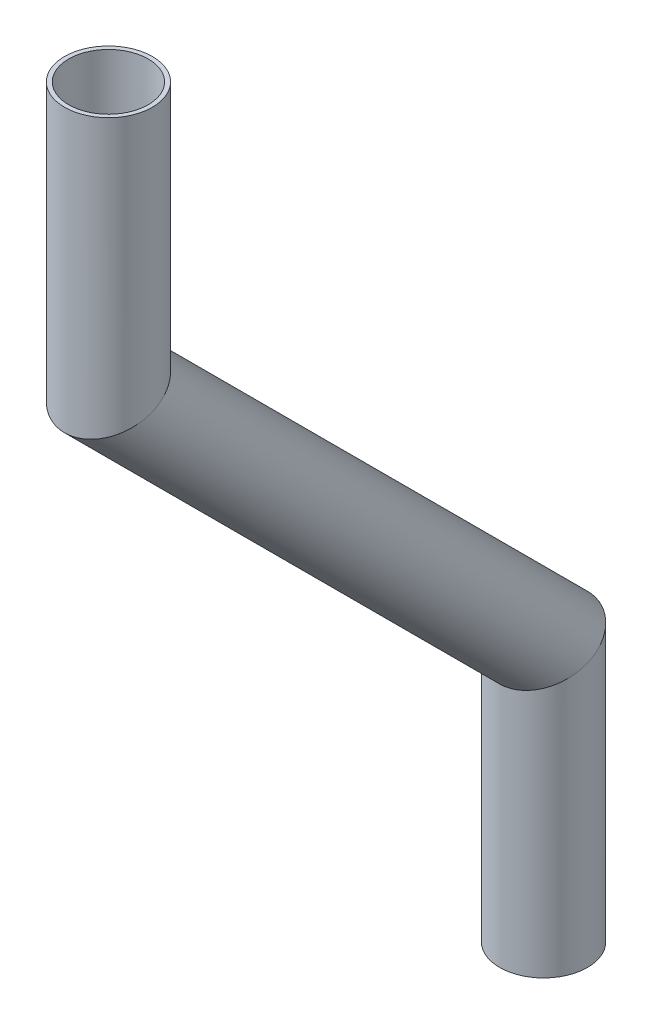
ISO-10303-21;
HEADER;
FILE_DESCRIPTION(('STEP AP214'),'2;1');
FILE_NAME('part.step','',(''),(''),'','','');
FILE_SCHEMA(('AUTOMOTIVE_DESIGN { 1 0 10303 214 1 1 1 1 }'));
ENDSEC;
DATA;
#1=APPLICATION_CONTEXT('core data for automotive mechanical design processes');
#2=APPLICATION_PROTOCOL_DEFINITION('international standard','automotive_design',2000,#1);
#3=PRODUCT_CONTEXT('',#1,'mechanical');
#4=PRODUCT('Part','Part','',(#3));
#5=PRODUCT_RELATED_PRODUCT_CATEGORY('part','',(#4));
#6=PRODUCT_DEFINITION_FORMATION('','',#4);
#7=PRODUCT_DEFINITION_CONTEXT('part definition',#1,'design');
#8=PRODUCT_DEFINITION('design','',#6,#7);
#9=PRODUCT_DEFINITION_SHAPE('','',#8);
#10=(LENGTH_UNIT() NAMED_UNIT(*) SI_UNIT(.MILLI.,.METRE.));
#11=(NAMED_UNIT(*) PLANE_ANGLE_UNIT() SI_UNIT($,.RADIAN.));
#12=(NAMED_UNIT(*) SI_UNIT($,.STERADIAN.) SOLID_ANGLE_UNIT());
#13=UNCERTAINTY_MEASURE_WITH_UNIT(LENGTH_MEASURE(1.E-05),#10,'distance_accuracy_value','');
#14=(GEOMETRIC_REPRESENTATION_CONTEXT(3) GLOBAL_UNCERTAINTY_ASSIGNED_CONTEXT((#13)) GLOBAL_UNIT_ASSIGNED_CONTEXT((#10,
#11,#12)) REPRESENTATION_CONTEXT('',''));
#15=CARTESIAN_POINT('',(0.,0.,0.));
#16=DIRECTION('',(0.,0.,1.));
#17=DIRECTION('',(1.,0.,0.));
#18=AXIS2_PLACEMENT_3D('',#15,#16,#17);
#19=CARTESIAN_POINT('',(0.,-88.616236302943,307.598264833907));
#20=DIRECTION('',(0.,1.,0.));
#21=DIRECTION('',(0.,0.,1.));
#22=AXIS2_PLACEMENT_3D('',#19,#20,#21);
#23=CYLINDRICAL_SURFACE('',#22,5.74039999999998);
#24=CARTESIAN_POINT('',(0.,-50.516236302943,307.598264833907));
#25=DIRECTION('',(0.,-1.,0.));
#26=DIRECTION('',(0.,0.,-1.));
#27=AXIS2_PLACEMENT_3D('',#24,#25,#26);
#28=CIRCLE('',#27,5.74039999999998);
#29=CARTESIAN_POINT('',(0.,-50.516236302943,301.857864833907));
#30=VERTEX_POINT('',#29);
#31=EDGE_CURVE('E66',#30,#30,#28,.T.);
#32=ORIENTED_EDGE('',*,*,#31,.F.);
#33=EDGE_LOOP('',(#32));
#34=FACE_BOUND('',#33,.T.);
#35=CARTESIAN_POINT('',(0.,-88.616236302943,307.598264833907));
#36=DIRECTION('',(0.,-0.923879532511286,-0.382683432365092));
#37=DIRECTION('',(0.,0.382683432365092,-0.923879532511286));
#38=AXIS2_PLACEMENT_3D('',#35,#36,#37);
#39=ELLIPSE('',#38,6.21336418655844,5.74039999999998);
#40=CARTESIAN_POINT('',(0.,-86.2384847694965,301.857864833907));
#41=VERTEX_POINT('',#40);
#42=EDGE_CURVE('E62',#41,#41,#39,.T.);
#43=ORIENTED_EDGE('',*,*,#42,.T.);
#44=EDGE_LOOP('',(#43));
#45=FACE_BOUND('',#44,.T.);
#46=ADVANCED_FACE('F58',(#34,#45),#23,.F.);
#47=CARTESIAN_POINT('',(0.,-88.616236302943,307.598264833907));
#48=DIRECTION('',(0.,1.,0.));
#49=DIRECTION('',(0.,0.,1.));
#50=AXIS2_PLACEMENT_3D('',#47,#48,#49);
#51=CYLINDRICAL_SURFACE('',#50,6.35);
#52=CARTESIAN_POINT('',(0.,-50.516236302943,307.598264833907));
#53=DIRECTION('',(0.,-1.,0.));
#54=DIRECTION('',(0.,0.,-1.));
#55=AXIS2_PLACEMENT_3D('',#52,#53,#54);
#56=CIRCLE('',#55,6.35);
#57=CARTESIAN_POINT('',(0.,-50.516236302943,301.248264833907));
#58=VERTEX_POINT('',#57);
#59=EDGE_CURVE('E70',#58,#58,#56,.T.);
#60=ORIENTED_EDGE('',*,*,#59,.T.);
#61=EDGE_LOOP('',(#60));
#62=FACE_BOUND('',#61,.T.);
#63=CARTESIAN_POINT('',(0.,-88.616236302943,307.598264833907));
#64=DIRECTION('',(0.,-0.923879532511286,-0.382683432365092));
#65=DIRECTION('',(0.,0.382683432365092,-0.923879532511286));
#66=AXIS2_PLACEMENT_3D('',#63,#64,#65);
#67=ELLIPSE('',#66,6.8731904718567,6.35);
#68=CARTESIAN_POINT('',(0.,-85.9859801818739,301.248264833907));
#69=VERTEX_POINT('',#68);
#70=EDGE_CURVE('E14',#69,#69,#67,.T.);
#71=ORIENTED_EDGE('',*,*,#70,.F.);
#72=EDGE_LOOP('',(#71));
#73=FACE_BOUND('',#72,.T.);
#74=ADVANCED_FACE('F85',(#62,#73),#51,.T.);
#75=CARTESIAN_POINT('',(0.,-50.516236302943,307.598264833907));
#76=DIRECTION('',(0.,-1.,0.));
#77=DIRECTION('',(0.,0.,-1.));
#78=AXIS2_PLACEMENT_3D('',#75,#76,#77);
#79=PLANE('',#78);
#80=ORIENTED_EDGE('',*,*,#31,.T.);
#81=EDGE_LOOP('',(#80));
#82=FACE_BOUND('',#81,.T.);
#83=ORIENTED_EDGE('',*,*,#59,.F.);
#84=EDGE_LOOP('',(#83));
#85=FACE_BOUND('',#84,.T.);
#86=ADVANCED_FACE('F81',(#82,#85),#79,.F.);
#87=CARTESIAN_POINT('',(0.,-88.616236302943,307.598264833907));
#88=DIRECTION('',(0.,-0.923879532511286,-0.382683432365092));
#89=DIRECTION('',(0.,0.382683432365092,-0.923879532511286));
#90=AXIS2_PLACEMENT_3D('',#87,#88,#89);
#91=PLANE('',#90);
#92=ORIENTED_EDGE('',*,*,#42,.F.);
#93=EDGE_LOOP('',(#92));
#94=FACE_BOUND('',#93,.T.);
#95=ORIENTED_EDGE('',*,*,#70,.T.);
#96=EDGE_LOOP('',(#95));
#97=FACE_BOUND('',#96,.T.);
#98=ADVANCED_FACE('F60',(#94,#97),#91,.T.);
#99=CLOSED_SHELL('',(#46,#74,#86,#98));
#100=MANIFOLD_SOLID_BREP('B2',#99);
#101=CARTESIAN_POINT('',(0.,-151.478029150427,244.736471986423));
#102=DIRECTION('',(0.,0.707106781186545,0.707106781186549));
#103=DIRECTION('',(0.,-0.707106781186549,0.707106781186546));
#104=AXIS2_PLACEMENT_3D('',#101,#102,#103);
#105=CYLINDRICAL_SURFACE('',#104,5.74039999999998);
#106=CARTESIAN_POINT('',(0.,-151.478029150427,244.736471986423));
#107=DIRECTION('',(0.,-0.923879532511286,-0.382683432365092));
#108=DIRECTION('',(0.,-0.382683432365092,0.923879532511286));
#109=AXIS2_PLACEMENT_3D('',#106,#107,#108);
#110=ELLIPSE('',#109,6.21336418655844,5.74039999999998);
#111=CARTESIAN_POINT('',(0.,-153.855780683873,250.476871986423));
#112=VERTEX_POINT('',#111);
#113=EDGE_CURVE('E167',#112,#112,#110,.T.);
#114=ORIENTED_EDGE('',*,*,#113,.T.);
#115=EDGE_LOOP('',(#114));
#116=FACE_BOUND('',#115,.T.);
#117=CARTESIAN_POINT('',(0.,-88.616236302943,307.598264833907));
#118=DIRECTION('',(0.,0.923879532511286,0.382683432365092));
#119=DIRECTION('',(0.,-0.382683432365092,0.923879532511286));
#120=AXIS2_PLACEMENT_3D('',#117,#118,#119);
#121=ELLIPSE('',#120,6.21336418655844,5.74039999999998);
#122=CARTESIAN_POINT('',(0.,-90.9939878363895,313.338664833907));
#123=VERTEX_POINT('',#122);
#124=EDGE_CURVE('E157',#123,#123,#121,.T.);
#125=ORIENTED_EDGE('',*,*,#124,.T.);
#126=EDGE_LOOP('',(#125));
#127=FACE_BOUND('',#126,.T.);
#128=ADVANCED_FACE('F153',(#116,#127),#105,.F.);
#129=CARTESIAN_POINT('',(0.,-151.478029150427,244.736471986423));
#130=DIRECTION('',(0.,0.707106781186545,0.707106781186549));
#131=DIRECTION('',(0.,-0.707106781186549,0.707106781186546));
#132=AXIS2_PLACEMENT_3D('',#129,#130,#131);
#133=CYLINDRICAL_SURFACE('',#132,6.35);
#134=CARTESIAN_POINT('',(0.,-151.478029150427,244.736471986423));
#135=DIRECTION('',(0.,-0.923879532511286,-0.382683432365092));
#136=DIRECTION('',(0.,-0.382683432365092,0.923879532511286));
#137=AXIS2_PLACEMENT_3D('',#134,#135,#136);
#138=ELLIPSE('',#137,6.8731904718567,6.35);
#139=CARTESIAN_POINT('',(0.,-154.108285271496,251.086471986423));
#140=VERTEX_POINT('',#139);
#141=EDGE_CURVE('E161',#140,#140,#138,.T.);
#142=ORIENTED_EDGE('',*,*,#141,.F.);
#143=EDGE_LOOP('',(#142));
#144=FACE_BOUND('',#143,.T.);
#145=CARTESIAN_POINT('',(0.,-88.616236302943,307.598264833907));
#146=DIRECTION('',(0.,0.923879532511286,0.382683432365092));
#147=DIRECTION('',(0.,-0.382683432365092,0.923879532511286));
#148=AXIS2_PLACEMENT_3D('',#145,#146,#147);
#149=ELLIPSE('',#148,6.8731904718567,6.35);
#150=CARTESIAN_POINT('',(0.,-91.2464924240122,313.948264833907));
#151=VERTEX_POINT('',#150);
#152=EDGE_CURVE('E57',#151,#151,#149,.T.);
#153=ORIENTED_EDGE('',*,*,#152,.F.);
#154=EDGE_LOOP('',(#153));
#155=FACE_BOUND('',#154,.T.);
#156=ADVANCED_FACE('F180',(#144,#155),#133,.T.);
#157=CARTESIAN_POINT('',(0.,-151.478029150427,244.736471986423));
#158=DIRECTION('',(0.,-0.923879532511286,-0.382683432365092));
#159=DIRECTION('',(0.,0.382683432365092,-0.923879532511286));
#160=AXIS2_PLACEMENT_3D('',#157,#158,#159);
#161=PLANE('',#160);
#162=ORIENTED_EDGE('',*,*,#113,.F.);
#163=EDGE_LOOP('',(#162));
#164=FACE_BOUND('',#163,.T.);
#165=ORIENTED_EDGE('',*,*,#141,.T.);
#166=EDGE_LOOP('',(#165));
#167=FACE_BOUND('',#166,.T.);
#168=ADVANCED_FACE('F176',(#164,#167),#161,.T.);
#169=CARTESIAN_POINT('',(0.,-88.616236302943,307.598264833907));
#170=DIRECTION('',(0.,0.923879532511286,0.382683432365092));
#171=DIRECTION('',(0.,-0.382683432365092,0.923879532511286));
#172=AXIS2_PLACEMENT_3D('',#169,#170,#171);
#173=PLANE('',#172);
#174=ORIENTED_EDGE('',*,*,#124,.F.);
#175=EDGE_LOOP('',(#174));
#176=FACE_BOUND('',#175,.T.);
#177=ORIENTED_EDGE('',*,*,#152,.T.);
#178=EDGE_LOOP('',(#177));
#179=FACE_BOUND('',#178,.T.);
#180=ADVANCED_FACE('F155',(#176,#179),#173,.T.);
#181=CLOSED_SHELL('',(#128,#156,#168,#180));
#182=MANIFOLD_SOLID_BREP('B9',#181);
#183=CARTESIAN_POINT('',(0.,-189.578029150427,244.736471986423));
#184=DIRECTION('',(0.,1.,0.));
#185=DIRECTION('',(0.,0.,1.));
#186=AXIS2_PLACEMENT_3D('',#183,#184,#185);
#187=CYLINDRICAL_SURFACE('',#186,5.74039999999998);
#188=CARTESIAN_POINT('',(0.,-189.578029150427,244.736471986423));
#189=DIRECTION('',(0.,-1.,0.));
#190=DIRECTION('',(0.,0.,-1.));
#191=AXIS2_PLACEMENT_3D('',#188,#189,#190);
#192=CIRCLE('',#191,5.74039999999998);
#193=CARTESIAN_POINT('',(0.,-189.578029150427,238.996071986423));
#194=VERTEX_POINT('',#193);
#195=EDGE_CURVE('E255',#194,#194,#192,.T.);
#196=ORIENTED_EDGE('',*,*,#195,.T.);
#197=EDGE_LOOP('',(#196));
#198=FACE_BOUND('',#197,.T.);
#199=CARTESIAN_POINT('',(0.,-151.478029150427,244.736471986423));
#200=DIRECTION('',(0.,0.923879532511286,0.382683432365092));
#201=DIRECTION('',(0.,0.382683432365092,-0.923879532511286));
#202=AXIS2_PLACEMENT_3D('',#199,#200,#201);
#203=ELLIPSE('',#202,6.21336418655844,5.74039999999998);
#204=CARTESIAN_POINT('',(0.,-149.10027761698,238.996071986423));
#205=VERTEX_POINT('',#204);
#206=EDGE_CURVE('E245',#205,#205,#203,.T.);
#207=ORIENTED_EDGE('',*,*,#206,.T.);
#208=EDGE_LOOP('',(#207));
#209=FACE_BOUND('',#208,.T.);
#210=ADVANCED_FACE('F241',(#198,#209),#187,.F.);
#211=CARTESIAN_POINT('',(0.,-189.578029150427,244.736471986423));
#212=DIRECTION('',(0.,1.,0.));
#213=DIRECTION('',(0.,0.,1.));
#214=AXIS2_PLACEMENT_3D('',#211,#212,#213);
#215=CYLINDRICAL_SURFACE('',#214,6.35);
#216=CARTESIAN_POINT('',(0.,-189.578029150427,244.736471986423));
#217=DIRECTION('',(0.,-1.,0.));
#218=DIRECTION('',(0.,0.,-1.));
#219=AXIS2_PLACEMENT_3D('',#216,#217,#218);
#220=CIRCLE('',#219,6.35);
#221=CARTESIAN_POINT('',(0.,-189.578029150427,238.386471986423));
#222=VERTEX_POINT('',#221);
#223=EDGE_CURVE('E249',#222,#222,#220,.T.);
#224=ORIENTED_EDGE('',*,*,#223,.F.);
#225=EDGE_LOOP('',(#224));
#226=FACE_BOUND('',#225,.T.);
#227=CARTESIAN_POINT('',(0.,-151.478029150427,244.736471986423));
#228=DIRECTION('',(0.,0.923879532511286,0.382683432365092));
#229=DIRECTION('',(0.,0.382683432365092,-0.923879532511286));
#230=AXIS2_PLACEMENT_3D('',#227,#228,#229);
#231=ELLIPSE('',#230,6.8731904718567,6.35);
#232=CARTESIAN_POINT('',(0.,-148.847773029358,238.386471986423));
#233=VERTEX_POINT('',#232);
#234=EDGE_CURVE('E152',#233,#233,#231,.T.);
#235=ORIENTED_EDGE('',*,*,#234,.F.);
#236=EDGE_LOOP('',(#235));
#237=FACE_BOUND('',#236,.T.);
#238=ADVANCED_FACE('F268',(#226,#237),#215,.T.);
#239=CARTESIAN_POINT('',(0.,-189.578029150427,244.736471986423));
#240=DIRECTION('',(0.,-1.,0.));
#241=DIRECTION('',(0.,0.,-1.));
#242=AXIS2_PLACEMENT_3D('',#239,#240,#241);
#243=PLANE('',#242);
#244=ORIENTED_EDGE('',*,*,#195,.F.);
#245=EDGE_LOOP('',(#244));
#246=FACE_BOUND('',#245,.T.);
#247=ORIENTED_EDGE('',*,*,#223,.T.);
#248=EDGE_LOOP('',(#247));
#249=FACE_BOUND('',#248,.T.);
#250=ADVANCED_FACE('F264',(#246,#249),#243,.T.);
#251=CARTESIAN_POINT('',(0.,-151.478029150427,244.736471986423));
#252=DIRECTION('',(0.,0.923879532511286,0.382683432365092));
#253=DIRECTION('',(0.,-0.382683432365092,0.923879532511286));
#254=AXIS2_PLACEMENT_3D('',#251,#252,#253);
#255=PLANE('',#254);
#256=ORIENTED_EDGE('',*,*,#206,.F.);
#257=EDGE_LOOP('',(#256));
#258=FACE_BOUND('',#257,.T.);
#259=ORIENTED_EDGE('',*,*,#234,.T.);
#260=EDGE_LOOP('',(#259));
#261=FACE_BOUND('',#260,.T.);
#262=ADVANCED_FACE('F243',(#258,#261),#255,.T.);
#263=CLOSED_SHELL('',(#210,#238,#250,#262));
#264=MANIFOLD_SOLID_BREP('B52',#263);
#265=ADVANCED_BREP_SHAPE_REPRESENTATION('',(#18,#100,#182,#264),#14);
#266=SHAPE_DEFINITION_REPRESENTATION(#9,#265);
ENDSEC;
END-ISO-10303-21;
